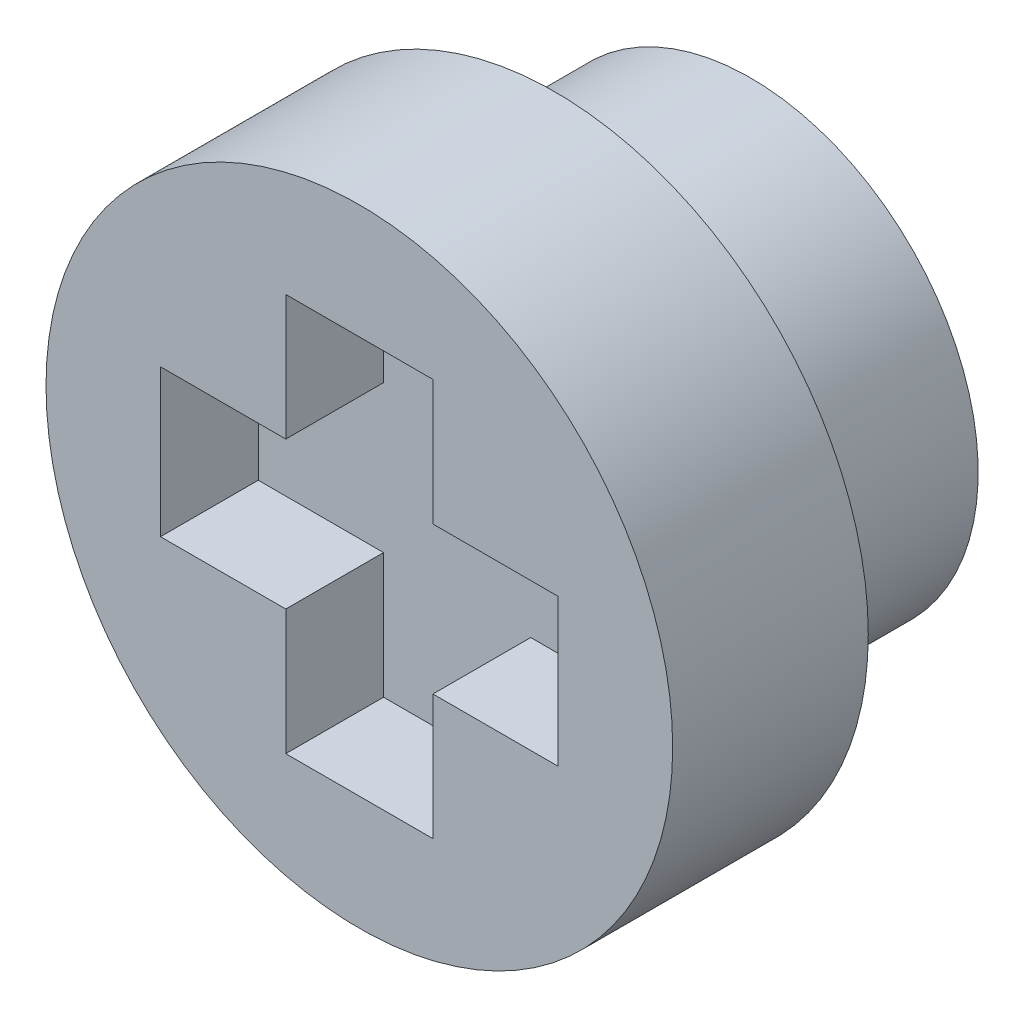
ISO-10303-21;
HEADER;
FILE_DESCRIPTION(('STEP AP214'),'2;1');
FILE_NAME('part.step','',(''),(''),'','','');
FILE_SCHEMA(('AUTOMOTIVE_DESIGN { 1 0 10303 214 1 1 1 1 }'));
ENDSEC;
DATA;
#1=APPLICATION_CONTEXT('core data for automotive mechanical design processes');
#2=APPLICATION_PROTOCOL_DEFINITION('international standard','automotive_design',2000,#1);
#3=PRODUCT_CONTEXT('',#1,'mechanical');
#4=PRODUCT('Part','Part','',(#3));
#5=PRODUCT_RELATED_PRODUCT_CATEGORY('part','',(#4));
#6=PRODUCT_DEFINITION_FORMATION('','',#4);
#7=PRODUCT_DEFINITION_CONTEXT('part definition',#1,'design');
#8=PRODUCT_DEFINITION('design','',#6,#7);
#9=PRODUCT_DEFINITION_SHAPE('','',#8);
#10=(LENGTH_UNIT() NAMED_UNIT(*) SI_UNIT(.MILLI.,.METRE.));
#11=(NAMED_UNIT(*) PLANE_ANGLE_UNIT() SI_UNIT($,.RADIAN.));
#12=(NAMED_UNIT(*) SI_UNIT($,.STERADIAN.) SOLID_ANGLE_UNIT());
#13=UNCERTAINTY_MEASURE_WITH_UNIT(LENGTH_MEASURE(1.E-05),#10,'distance_accuracy_value','');
#14=(GEOMETRIC_REPRESENTATION_CONTEXT(3) GLOBAL_UNCERTAINTY_ASSIGNED_CONTEXT((#13)) GLOBAL_UNIT_ASSIGNED_CONTEXT((#10,
#11,#12)) REPRESENTATION_CONTEXT('',''));
#15=CARTESIAN_POINT('',(0.,0.,0.));
#16=DIRECTION('',(0.,0.,1.));
#17=DIRECTION('',(1.,0.,0.));
#18=AXIS2_PLACEMENT_3D('',#15,#16,#17);
#19=CARTESIAN_POINT('',(26.67,-18.1463402370836,1.064));
#20=DIRECTION('',(0.,0.,1.));
#21=DIRECTION('',(1.,0.,0.));
#22=AXIS2_PLACEMENT_3D('',#19,#20,#21);
#23=PLANE('',#22);
#24=CARTESIAN_POINT('',(26.67,-18.1463402370836,1.064));
#25=DIRECTION('',(0.,0.,-1.));
#26=DIRECTION('',(-1.,0.,0.));
#27=AXIS2_PLACEMENT_3D('',#24,#25,#26);
#28=CIRCLE('',#27,3.4925);
#29=CARTESIAN_POINT('',(23.1775,-18.1463402370836,1.064));
#30=VERTEX_POINT('',#29);
#31=EDGE_CURVE('E18',#30,#30,#28,.F.);
#32=ORIENTED_EDGE('',*,*,#31,.F.);
#33=EDGE_LOOP('',(#32));
#34=FACE_BOUND('',#33,.T.);
#35=ADVANCED_FACE('F15',(#34),#23,.F.);
#36=CARTESIAN_POINT('',(26.67,-18.1463402370836,4.064));
#37=DIRECTION('',(0.,0.,-1.));
#38=DIRECTION('',(-1.,0.,0.));
#39=AXIS2_PLACEMENT_3D('',#36,#37,#38);
#40=CYLINDRICAL_SURFACE('',#39,3.4925);
#41=CARTESIAN_POINT('',(26.67,-18.1463402370836,4.064));
#42=DIRECTION('',(0.,0.,-1.));
#43=DIRECTION('',(-1.,0.,0.));
#44=AXIS2_PLACEMENT_3D('',#41,#42,#43);
#45=CIRCLE('',#44,3.4925);
#46=CARTESIAN_POINT('',(23.1775,-18.1463402370836,4.064));
#47=VERTEX_POINT('',#46);
#48=EDGE_CURVE('E120',#47,#47,#45,.T.);
#49=ORIENTED_EDGE('',*,*,#48,.T.);
#50=EDGE_LOOP('',(#49));
#51=FACE_BOUND('',#50,.T.);
#52=ORIENTED_EDGE('',*,*,#31,.T.);
#53=EDGE_LOOP('',(#52));
#54=FACE_BOUND('',#53,.T.);
#55=ADVANCED_FACE('F140',(#51,#54),#40,.T.);
#56=CARTESIAN_POINT('',(0.,0.,5.564));
#57=DIRECTION('',(0.,0.,1.));
#58=DIRECTION('',(1.,0.,0.));
#59=AXIS2_PLACEMENT_3D('',#56,#57,#58);
#60=PLANE('',#59);
#61=DIRECTION('',(0.,1.,0.));
#62=VECTOR('',#61,1.);
#63=CARTESIAN_POINT('',(27.7987674279046,-15.0960500809489,5.564));
#64=LINE('',#63,#62);
#65=CARTESIAN_POINT('',(27.7987674279046,-17.017572809179,5.564));
#66=VERTEX_POINT('',#65);
#67=CARTESIAN_POINT('',(27.7987674279046,-15.0960500809489,5.564));
#68=VERTEX_POINT('',#67);
#69=EDGE_CURVE('E102',#66,#68,#64,.T.);
#70=ORIENTED_EDGE('',*,*,#69,.T.);
#71=DIRECTION('',(1.,0.,0.));
#72=VECTOR('',#71,1.);
#73=CARTESIAN_POINT('',(27.7987674279046,-15.0960500809489,5.564));
#74=LINE('',#73,#72);
#75=CARTESIAN_POINT('',(25.5412325720954,-15.0960500809489,5.564));
#76=VERTEX_POINT('',#75);
#77=EDGE_CURVE('E104',#68,#76,#74,.F.);
#78=ORIENTED_EDGE('',*,*,#77,.T.);
#79=DIRECTION('',(0.,1.,0.));
#80=VECTOR('',#79,1.);
#81=CARTESIAN_POINT('',(25.5412325720954,-15.0960500809489,5.564));
#82=LINE('',#81,#80);
#83=CARTESIAN_POINT('',(25.5412325720954,-17.017572809179,5.564));
#84=VERTEX_POINT('',#83);
#85=EDGE_CURVE('E107',#76,#84,#82,.F.);
#86=ORIENTED_EDGE('',*,*,#85,.T.);
#87=DIRECTION('',(1.,0.,0.));
#88=VECTOR('',#87,1.);
#89=CARTESIAN_POINT('',(23.6197098438653,-17.017572809179,5.564));
#90=LINE('',#89,#88);
#91=CARTESIAN_POINT('',(23.6197098438653,-17.017572809179,5.564));
#92=VERTEX_POINT('',#91);
#93=EDGE_CURVE('E398',#84,#92,#90,.F.);
#94=ORIENTED_EDGE('',*,*,#93,.T.);
#95=DIRECTION('',(0.,-1.,0.));
#96=VECTOR('',#95,1.);
#97=CARTESIAN_POINT('',(23.6197098438653,-17.017572809179,5.564));
#98=LINE('',#97,#96);
#99=CARTESIAN_POINT('',(23.6197098438653,-19.2751076649882,5.564));
#100=VERTEX_POINT('',#99);
#101=EDGE_CURVE('E393',#92,#100,#98,.T.);
#102=ORIENTED_EDGE('',*,*,#101,.T.);
#103=DIRECTION('',(1.,0.,0.));
#104=VECTOR('',#103,1.);
#105=CARTESIAN_POINT('',(23.6197098438653,-19.2751076649882,5.564));
#106=LINE('',#105,#104);
#107=CARTESIAN_POINT('',(25.5412325720954,-19.2751076649882,5.564));
#108=VERTEX_POINT('',#107);
#109=EDGE_CURVE('E389',#100,#108,#106,.T.);
#110=ORIENTED_EDGE('',*,*,#109,.T.);
#111=DIRECTION('',(0.,-1.,0.));
#112=VECTOR('',#111,1.);
#113=CARTESIAN_POINT('',(25.5412325720954,-21.1966303932183,5.564));
#114=LINE('',#113,#112);
#115=CARTESIAN_POINT('',(25.5412325720954,-21.1966303932183,5.564));
#116=VERTEX_POINT('',#115);
#117=EDGE_CURVE('E385',#108,#116,#114,.T.);
#118=ORIENTED_EDGE('',*,*,#117,.T.);
#119=DIRECTION('',(1.,0.,0.));
#120=VECTOR('',#119,1.);
#121=CARTESIAN_POINT('',(25.5412325720954,-21.1966303932183,5.564));
#122=LINE('',#121,#120);
#123=CARTESIAN_POINT('',(27.7987674279046,-21.1966303932183,5.564));
#124=VERTEX_POINT('',#123);
#125=EDGE_CURVE('E381',#116,#124,#122,.T.);
#126=ORIENTED_EDGE('',*,*,#125,.T.);
#127=DIRECTION('',(0.,1.,0.));
#128=VECTOR('',#127,1.);
#129=CARTESIAN_POINT('',(27.7987674279046,-21.1966303932183,5.564));
#130=LINE('',#129,#128);
#131=CARTESIAN_POINT('',(27.7987674279046,-19.2751076649882,5.564));
#132=VERTEX_POINT('',#131);
#133=EDGE_CURVE('E377',#124,#132,#130,.T.);
#134=ORIENTED_EDGE('',*,*,#133,.T.);
#135=DIRECTION('',(1.,0.,0.));
#136=VECTOR('',#135,1.);
#137=CARTESIAN_POINT('',(29.7202901561347,-19.2751076649882,5.564));
#138=LINE('',#137,#136);
#139=CARTESIAN_POINT('',(29.7202901561347,-19.2751076649882,5.564));
#140=VERTEX_POINT('',#139);
#141=EDGE_CURVE('E373',#132,#140,#138,.T.);
#142=ORIENTED_EDGE('',*,*,#141,.T.);
#143=DIRECTION('',(0.,1.,0.));
#144=VECTOR('',#143,1.);
#145=CARTESIAN_POINT('',(29.7202901561347,-19.2751076649882,5.564));
#146=LINE('',#145,#144);
#147=CARTESIAN_POINT('',(29.7202901561347,-17.017572809179,5.564));
#148=VERTEX_POINT('',#147);
#149=EDGE_CURVE('E369',#140,#148,#146,.T.);
#150=ORIENTED_EDGE('',*,*,#149,.T.);
#151=DIRECTION('',(1.,0.,0.));
#152=VECTOR('',#151,1.);
#153=CARTESIAN_POINT('',(29.7202901561347,-17.017572809179,5.564));
#154=LINE('',#153,#152);
#155=EDGE_CURVE('E364',#148,#66,#154,.F.);
#156=ORIENTED_EDGE('',*,*,#155,.T.);
#157=EDGE_LOOP('',(#70,#78,#86,#94,#102,#110,#118,#126,#134,#142,#150,#156));
#158=FACE_BOUND('',#157,.T.);
#159=ADVANCED_FACE('F106',(#158),#60,.T.);
#160=CARTESIAN_POINT('',(10.9562814285125,32.2243571426838,4.064));
#161=DIRECTION('',(0.,0.,1.));
#162=DIRECTION('',(1.,0.,0.));
#163=AXIS2_PLACEMENT_3D('',#160,#161,#162);
#164=PLANE('',#163);
#165=ORIENTED_EDGE('',*,*,#48,.F.);
#166=EDGE_LOOP('',(#165));
#167=FACE_BOUND('',#166,.T.);
#168=CARTESIAN_POINT('',(26.67,-18.1463402370836,4.064));
#169=DIRECTION('',(0.,0.,1.));
#170=DIRECTION('',(1.,0.,0.));
#171=AXIS2_PLACEMENT_3D('',#168,#169,#170);
#172=CIRCLE('',#171,4.80655319366203);
#173=CARTESIAN_POINT('',(31.476553193662,-18.1463402370836,4.064));
#174=VERTEX_POINT('',#173);
#175=EDGE_CURVE('E131',#174,#174,#172,.T.);
#176=ORIENTED_EDGE('',*,*,#175,.F.);
#177=EDGE_LOOP('',(#176));
#178=FACE_BOUND('',#177,.T.);
#179=ADVANCED_FACE('F202',(#167,#178),#164,.F.);
#180=CARTESIAN_POINT('',(25.5412325720954,-15.0960500809489,5.564));
#181=DIRECTION('',(-1.,0.,0.));
#182=DIRECTION('',(0.,0.,1.));
#183=AXIS2_PLACEMENT_3D('',#180,#181,#182);
#184=PLANE('',#183);
#185=DIRECTION('',(0.,0.,1.));
#186=VECTOR('',#185,1.);
#187=CARTESIAN_POINT('',(25.5412325720954,-17.017572809179,5.564));
#188=LINE('',#187,#186);
#189=CARTESIAN_POINT('',(25.5412325720954,-17.017572809179,7.064));
#190=VERTEX_POINT('',#189);
#191=EDGE_CURVE('E118',#190,#84,#188,.F.);
#192=ORIENTED_EDGE('',*,*,#191,.T.);
#193=ORIENTED_EDGE('',*,*,#85,.F.);
#194=DIRECTION('',(0.,0.,1.));
#195=VECTOR('',#194,1.);
#196=CARTESIAN_POINT('',(25.5412325720954,-15.0960500809489,5.564));
#197=LINE('',#196,#195);
#198=CARTESIAN_POINT('',(25.5412325720954,-15.0960500809489,7.064));
#199=VERTEX_POINT('',#198);
#200=EDGE_CURVE('E112',#76,#199,#197,.T.);
#201=ORIENTED_EDGE('',*,*,#200,.T.);
#202=DIRECTION('',(0.,1.,0.));
#203=VECTOR('',#202,1.);
#204=CARTESIAN_POINT('',(25.5412325720954,-18.1463402370836,7.064));
#205=LINE('',#204,#203);
#206=EDGE_CURVE('E133',#190,#199,#205,.T.);
#207=ORIENTED_EDGE('',*,*,#206,.F.);
#208=EDGE_LOOP('',(#192,#193,#201,#207));
#209=FACE_BOUND('',#208,.T.);
#210=ADVANCED_FACE('F115',(#209),#184,.F.);
#211=CARTESIAN_POINT('',(27.7987674279046,-15.0960500809489,5.564));
#212=DIRECTION('',(0.,1.,0.));
#213=DIRECTION('',(0.,0.,1.));
#214=AXIS2_PLACEMENT_3D('',#211,#212,#213);
#215=PLANE('',#214);
#216=ORIENTED_EDGE('',*,*,#200,.F.);
#217=ORIENTED_EDGE('',*,*,#77,.F.);
#218=DIRECTION('',(0.,0.,-1.));
#219=VECTOR('',#218,1.);
#220=CARTESIAN_POINT('',(27.7987674279046,-15.0960500809489,5.564));
#221=LINE('',#220,#219);
#222=CARTESIAN_POINT('',(27.7987674279046,-15.0960500809489,7.064));
#223=VERTEX_POINT('',#222);
#224=EDGE_CURVE('E127',#68,#223,#221,.F.);
#225=ORIENTED_EDGE('',*,*,#224,.T.);
#226=DIRECTION('',(1.,0.,0.));
#227=VECTOR('',#226,1.);
#228=CARTESIAN_POINT('',(26.67,-15.0960500809489,7.064));
#229=LINE('',#228,#227);
#230=EDGE_CURVE('E124',#199,#223,#229,.T.);
#231=ORIENTED_EDGE('',*,*,#230,.F.);
#232=EDGE_LOOP('',(#216,#217,#225,#231));
#233=FACE_BOUND('',#232,.T.);
#234=ADVANCED_FACE('F122',(#233),#215,.F.);
#235=CARTESIAN_POINT('',(27.7987674279046,-15.0960500809489,5.564));
#236=DIRECTION('',(1.,0.,0.));
#237=DIRECTION('',(0.,0.,-1.));
#238=AXIS2_PLACEMENT_3D('',#235,#236,#237);
#239=PLANE('',#238);
#240=ORIENTED_EDGE('',*,*,#224,.F.);
#241=ORIENTED_EDGE('',*,*,#69,.F.);
#242=DIRECTION('',(0.,0.,1.));
#243=VECTOR('',#242,1.);
#244=CARTESIAN_POINT('',(27.7987674279046,-17.017572809179,5.564));
#245=LINE('',#244,#243);
#246=CARTESIAN_POINT('',(27.7987674279046,-17.017572809179,7.064));
#247=VERTEX_POINT('',#246);
#248=EDGE_CURVE('E365',#66,#247,#245,.T.);
#249=ORIENTED_EDGE('',*,*,#248,.T.);
#250=DIRECTION('',(0.,1.,0.));
#251=VECTOR('',#250,1.);
#252=CARTESIAN_POINT('',(27.7987674279046,-18.1463402370836,7.064));
#253=LINE('',#252,#251);
#254=EDGE_CURVE('E363',#223,#247,#253,.F.);
#255=ORIENTED_EDGE('',*,*,#254,.F.);
#256=EDGE_LOOP('',(#240,#241,#249,#255));
#257=FACE_BOUND('',#256,.T.);
#258=ADVANCED_FACE('F193',(#257),#239,.F.);
#259=CARTESIAN_POINT('',(29.7202901561347,-17.017572809179,5.564));
#260=DIRECTION('',(0.,1.,0.));
#261=DIRECTION('',(0.,0.,1.));
#262=AXIS2_PLACEMENT_3D('',#259,#260,#261);
#263=PLANE('',#262);
#264=ORIENTED_EDGE('',*,*,#248,.F.);
#265=ORIENTED_EDGE('',*,*,#155,.F.);
#266=DIRECTION('',(0.,0.,1.));
#267=VECTOR('',#266,1.);
#268=CARTESIAN_POINT('',(29.7202901561347,-17.017572809179,5.564));
#269=LINE('',#268,#267);
#270=CARTESIAN_POINT('',(29.7202901561347,-17.017572809179,7.064));
#271=VERTEX_POINT('',#270);
#272=EDGE_CURVE('E371',#148,#271,#269,.T.);
#273=ORIENTED_EDGE('',*,*,#272,.T.);
#274=DIRECTION('',(1.,0.,0.));
#275=VECTOR('',#274,1.);
#276=CARTESIAN_POINT('',(26.67,-17.017572809179,7.064));
#277=LINE('',#276,#275);
#278=EDGE_CURVE('E404',#247,#271,#277,.T.);
#279=ORIENTED_EDGE('',*,*,#278,.F.);
#280=EDGE_LOOP('',(#264,#265,#273,#279));
#281=FACE_BOUND('',#280,.T.);
#282=ADVANCED_FACE('F189',(#281),#263,.F.);
#283=CARTESIAN_POINT('',(29.7202901561347,-19.2751076649882,5.564));
#284=DIRECTION('',(1.,0.,0.));
#285=DIRECTION('',(0.,1.,0.));
#286=AXIS2_PLACEMENT_3D('',#283,#284,#285);
#287=PLANE('',#286);
#288=ORIENTED_EDGE('',*,*,#272,.F.);
#289=ORIENTED_EDGE('',*,*,#149,.F.);
#290=DIRECTION('',(0.,0.,1.));
#291=VECTOR('',#290,1.);
#292=CARTESIAN_POINT('',(29.7202901561347,-19.2751076649882,5.564));
#293=LINE('',#292,#291);
#294=CARTESIAN_POINT('',(29.7202901561347,-19.2751076649882,7.064));
#295=VERTEX_POINT('',#294);
#296=EDGE_CURVE('E375',#140,#295,#293,.T.);
#297=ORIENTED_EDGE('',*,*,#296,.T.);
#298=DIRECTION('',(0.,1.,0.));
#299=VECTOR('',#298,1.);
#300=CARTESIAN_POINT('',(29.7202901561347,-18.1463402370836,7.064));
#301=LINE('',#300,#299);
#302=EDGE_CURVE('E407',#271,#295,#301,.F.);
#303=ORIENTED_EDGE('',*,*,#302,.F.);
#304=EDGE_LOOP('',(#288,#289,#297,#303));
#305=FACE_BOUND('',#304,.T.);
#306=ADVANCED_FACE('F185',(#305),#287,.F.);
#307=CARTESIAN_POINT('',(29.7202901561347,-19.2751076649882,5.564));
#308=DIRECTION('',(0.,-1.,0.));
#309=DIRECTION('',(1.,0.,0.));
#310=AXIS2_PLACEMENT_3D('',#307,#308,#309);
#311=PLANE('',#310);
#312=ORIENTED_EDGE('',*,*,#296,.F.);
#313=ORIENTED_EDGE('',*,*,#141,.F.);
#314=DIRECTION('',(0.,0.,1.));
#315=VECTOR('',#314,1.);
#316=CARTESIAN_POINT('',(27.7987674279046,-19.2751076649882,5.564));
#317=LINE('',#316,#315);
#318=CARTESIAN_POINT('',(27.7987674279046,-19.2751076649882,7.064));
#319=VERTEX_POINT('',#318);
#320=EDGE_CURVE('E379',#132,#319,#317,.T.);
#321=ORIENTED_EDGE('',*,*,#320,.T.);
#322=DIRECTION('',(1.,0.,0.));
#323=VECTOR('',#322,1.);
#324=CARTESIAN_POINT('',(26.67,-19.2751076649882,7.064));
#325=LINE('',#324,#323);
#326=EDGE_CURVE('E410',#295,#319,#325,.F.);
#327=ORIENTED_EDGE('',*,*,#326,.F.);
#328=EDGE_LOOP('',(#312,#313,#321,#327));
#329=FACE_BOUND('',#328,.T.);
#330=ADVANCED_FACE('F181',(#329),#311,.F.);
#331=CARTESIAN_POINT('',(27.7987674279046,-21.1966303932183,5.564));
#332=DIRECTION('',(1.,0.,0.));
#333=DIRECTION('',(0.,1.,0.));
#334=AXIS2_PLACEMENT_3D('',#331,#332,#333);
#335=PLANE('',#334);
#336=ORIENTED_EDGE('',*,*,#320,.F.);
#337=ORIENTED_EDGE('',*,*,#133,.F.);
#338=DIRECTION('',(0.,0.,1.));
#339=VECTOR('',#338,1.);
#340=CARTESIAN_POINT('',(27.7987674279046,-21.1966303932183,5.564));
#341=LINE('',#340,#339);
#342=CARTESIAN_POINT('',(27.7987674279046,-21.1966303932183,7.064));
#343=VERTEX_POINT('',#342);
#344=EDGE_CURVE('E383',#124,#343,#341,.T.);
#345=ORIENTED_EDGE('',*,*,#344,.T.);
#346=DIRECTION('',(0.,1.,0.));
#347=VECTOR('',#346,1.);
#348=CARTESIAN_POINT('',(27.7987674279046,-18.1463402370836,7.064));
#349=LINE('',#348,#347);
#350=EDGE_CURVE('E413',#319,#343,#349,.F.);
#351=ORIENTED_EDGE('',*,*,#350,.F.);
#352=EDGE_LOOP('',(#336,#337,#345,#351));
#353=FACE_BOUND('',#352,.T.);
#354=ADVANCED_FACE('F177',(#353),#335,.F.);
#355=CARTESIAN_POINT('',(25.5412325720954,-21.1966303932183,5.564));
#356=DIRECTION('',(0.,-1.,0.));
#357=DIRECTION('',(1.,0.,0.));
#358=AXIS2_PLACEMENT_3D('',#355,#356,#357);
#359=PLANE('',#358);
#360=ORIENTED_EDGE('',*,*,#344,.F.);
#361=ORIENTED_EDGE('',*,*,#125,.F.);
#362=DIRECTION('',(0.,0.,1.));
#363=VECTOR('',#362,1.);
#364=CARTESIAN_POINT('',(25.5412325720954,-21.1966303932183,5.564));
#365=LINE('',#364,#363);
#366=CARTESIAN_POINT('',(25.5412325720954,-21.1966303932183,7.064));
#367=VERTEX_POINT('',#366);
#368=EDGE_CURVE('E387',#116,#367,#365,.T.);
#369=ORIENTED_EDGE('',*,*,#368,.T.);
#370=DIRECTION('',(1.,0.,0.));
#371=VECTOR('',#370,1.);
#372=CARTESIAN_POINT('',(26.67,-21.1966303932183,7.064));
#373=LINE('',#372,#371);
#374=EDGE_CURVE('E416',#343,#367,#373,.F.);
#375=ORIENTED_EDGE('',*,*,#374,.F.);
#376=EDGE_LOOP('',(#360,#361,#369,#375));
#377=FACE_BOUND('',#376,.T.);
#378=ADVANCED_FACE('F173',(#377),#359,.F.);
#379=CARTESIAN_POINT('',(25.5412325720954,-21.1966303932183,5.564));
#380=DIRECTION('',(-1.,0.,0.));
#381=DIRECTION('',(0.,-1.,0.));
#382=AXIS2_PLACEMENT_3D('',#379,#380,#381);
#383=PLANE('',#382);
#384=ORIENTED_EDGE('',*,*,#368,.F.);
#385=ORIENTED_EDGE('',*,*,#117,.F.);
#386=DIRECTION('',(0.,0.,1.));
#387=VECTOR('',#386,1.);
#388=CARTESIAN_POINT('',(25.5412325720954,-19.2751076649882,5.564));
#389=LINE('',#388,#387);
#390=CARTESIAN_POINT('',(25.5412325720954,-19.2751076649882,7.064));
#391=VERTEX_POINT('',#390);
#392=EDGE_CURVE('E391',#108,#391,#389,.T.);
#393=ORIENTED_EDGE('',*,*,#392,.T.);
#394=DIRECTION('',(0.,1.,0.));
#395=VECTOR('',#394,1.);
#396=CARTESIAN_POINT('',(25.5412325720954,-18.1463402370836,7.064));
#397=LINE('',#396,#395);
#398=EDGE_CURVE('E419',#367,#391,#397,.T.);
#399=ORIENTED_EDGE('',*,*,#398,.F.);
#400=EDGE_LOOP('',(#384,#385,#393,#399));
#401=FACE_BOUND('',#400,.T.);
#402=ADVANCED_FACE('F169',(#401),#383,.F.);
#403=CARTESIAN_POINT('',(23.6197098438653,-19.2751076649882,5.564));
#404=DIRECTION('',(0.,-1.,0.));
#405=DIRECTION('',(1.,0.,0.));
#406=AXIS2_PLACEMENT_3D('',#403,#404,#405);
#407=PLANE('',#406);
#408=ORIENTED_EDGE('',*,*,#392,.F.);
#409=ORIENTED_EDGE('',*,*,#109,.F.);
#410=DIRECTION('',(0.,0.,1.));
#411=VECTOR('',#410,1.);
#412=CARTESIAN_POINT('',(23.6197098438653,-19.2751076649882,5.564));
#413=LINE('',#412,#411);
#414=CARTESIAN_POINT('',(23.6197098438653,-19.2751076649882,7.064));
#415=VERTEX_POINT('',#414);
#416=EDGE_CURVE('E395',#100,#415,#413,.T.);
#417=ORIENTED_EDGE('',*,*,#416,.T.);
#418=DIRECTION('',(1.,0.,0.));
#419=VECTOR('',#418,1.);
#420=CARTESIAN_POINT('',(26.67,-19.2751076649882,7.064));
#421=LINE('',#420,#419);
#422=EDGE_CURVE('E422',#391,#415,#421,.F.);
#423=ORIENTED_EDGE('',*,*,#422,.F.);
#424=EDGE_LOOP('',(#408,#409,#417,#423));
#425=FACE_BOUND('',#424,.T.);
#426=ADVANCED_FACE('F166',(#425),#407,.F.);
#427=CARTESIAN_POINT('',(23.6197098438653,-17.017572809179,5.564));
#428=DIRECTION('',(-1.,0.,0.));
#429=DIRECTION('',(0.,-1.,0.));
#430=AXIS2_PLACEMENT_3D('',#427,#428,#429);
#431=PLANE('',#430);
#432=ORIENTED_EDGE('',*,*,#416,.F.);
#433=ORIENTED_EDGE('',*,*,#101,.F.);
#434=DIRECTION('',(0.,0.,1.));
#435=VECTOR('',#434,1.);
#436=CARTESIAN_POINT('',(23.6197098438653,-17.017572809179,5.564));
#437=LINE('',#436,#435);
#438=CARTESIAN_POINT('',(23.6197098438653,-17.017572809179,7.064));
#439=VERTEX_POINT('',#438);
#440=EDGE_CURVE('E33',#92,#439,#437,.T.);
#441=ORIENTED_EDGE('',*,*,#440,.T.);
#442=DIRECTION('',(0.,1.,0.));
#443=VECTOR('',#442,1.);
#444=CARTESIAN_POINT('',(23.6197098438653,-18.1463402370836,7.064));
#445=LINE('',#444,#443);
#446=EDGE_CURVE('E425',#415,#439,#445,.T.);
#447=ORIENTED_EDGE('',*,*,#446,.F.);
#448=EDGE_LOOP('',(#432,#433,#441,#447));
#449=FACE_BOUND('',#448,.T.);
#450=ADVANCED_FACE('F162',(#449),#431,.F.);
#451=CARTESIAN_POINT('',(23.6197098438653,-17.017572809179,5.564));
#452=DIRECTION('',(0.,1.,0.));
#453=DIRECTION('',(0.,0.,1.));
#454=AXIS2_PLACEMENT_3D('',#451,#452,#453);
#455=PLANE('',#454);
#456=ORIENTED_EDGE('',*,*,#440,.F.);
#457=ORIENTED_EDGE('',*,*,#93,.F.);
#458=ORIENTED_EDGE('',*,*,#191,.F.);
#459=DIRECTION('',(1.,0.,0.));
#460=VECTOR('',#459,1.);
#461=CARTESIAN_POINT('',(26.67,-17.017572809179,7.064));
#462=LINE('',#461,#460);
#463=EDGE_CURVE('E24',#439,#190,#462,.T.);
#464=ORIENTED_EDGE('',*,*,#463,.F.);
#465=EDGE_LOOP('',(#456,#457,#458,#464));
#466=FACE_BOUND('',#465,.T.);
#467=ADVANCED_FACE('F155',(#466),#455,.F.);
#468=CARTESIAN_POINT('',(26.67,-18.1463402370836,1.064));
#469=DIRECTION('',(0.,0.,1.));
#470=DIRECTION('',(1.,0.,0.));
#471=AXIS2_PLACEMENT_3D('',#468,#469,#470);
#472=CYLINDRICAL_SURFACE('',#471,4.80655319366203);
#473=CARTESIAN_POINT('',(26.67,-18.1463402370836,7.064));
#474=DIRECTION('',(0.,0.,1.));
#475=DIRECTION('',(1.,0.,0.));
#476=AXIS2_PLACEMENT_3D('',#473,#474,#475);
#477=CIRCLE('',#476,4.80655319366203);
#478=CARTESIAN_POINT('',(31.476553193662,-18.1463402370836,7.064));
#479=VERTEX_POINT('',#478);
#480=EDGE_CURVE('E9',#479,#479,#477,.T.);
#481=ORIENTED_EDGE('',*,*,#480,.F.);
#482=EDGE_LOOP('',(#481));
#483=FACE_BOUND('',#482,.T.);
#484=ORIENTED_EDGE('',*,*,#175,.T.);
#485=EDGE_LOOP('',(#484));
#486=FACE_BOUND('',#485,.T.);
#487=ADVANCED_FACE('F149',(#483,#486),#472,.T.);
#488=CARTESIAN_POINT('',(26.67,-18.1463402370836,7.064));
#489=DIRECTION('',(0.,0.,1.));
#490=DIRECTION('',(1.,0.,0.));
#491=AXIS2_PLACEMENT_3D('',#488,#489,#490);
#492=PLANE('',#491);
#493=ORIENTED_EDGE('',*,*,#480,.T.);
#494=EDGE_LOOP('',(#493));
#495=FACE_BOUND('',#494,.T.);
#496=ORIENTED_EDGE('',*,*,#446,.T.);
#497=ORIENTED_EDGE('',*,*,#463,.T.);
#498=ORIENTED_EDGE('',*,*,#206,.T.);
#499=ORIENTED_EDGE('',*,*,#230,.T.);
#500=ORIENTED_EDGE('',*,*,#254,.T.);
#501=ORIENTED_EDGE('',*,*,#278,.T.);
#502=ORIENTED_EDGE('',*,*,#302,.T.);
#503=ORIENTED_EDGE('',*,*,#326,.T.);
#504=ORIENTED_EDGE('',*,*,#350,.T.);
#505=ORIENTED_EDGE('',*,*,#374,.T.);
#506=ORIENTED_EDGE('',*,*,#398,.T.);
#507=ORIENTED_EDGE('',*,*,#422,.T.);
#508=EDGE_LOOP('',(#496,#497,#498,#499,#500,#501,#502,#503,#504,#505,#506,#507));
#509=FACE_BOUND('',#508,.T.);
#510=ADVANCED_FACE('F147',(#495,#509),#492,.T.);
#511=CLOSED_SHELL('',(#35,#55,#159,#179,#210,#234,#258,#282,#306,#330,#354,#378,#402,#426,#450,
#467,#487,#510));
#512=MANIFOLD_SOLID_BREP('B1',#511);
#513=ADVANCED_BREP_SHAPE_REPRESENTATION('',(#18,#512),#14);
#514=SHAPE_DEFINITION_REPRESENTATION(#9,#513);
ENDSEC;
END-ISO-10303-21;
